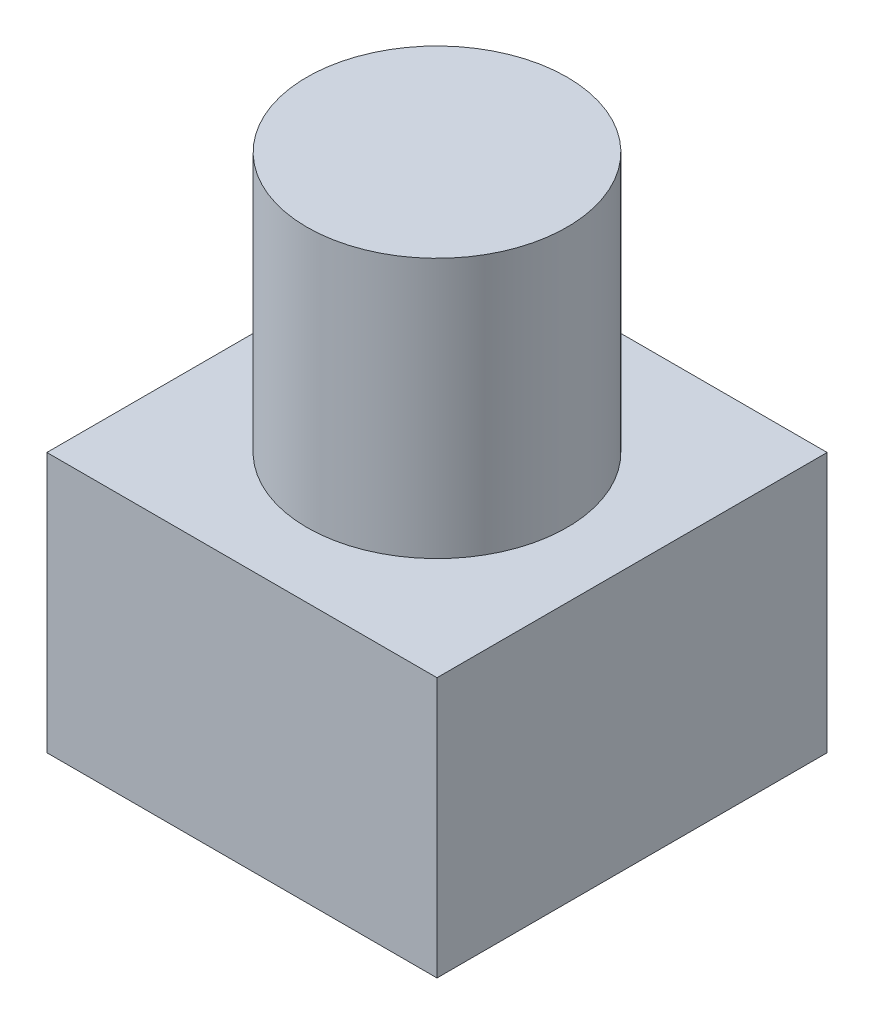
ISO-10303-21;
HEADER;
FILE_DESCRIPTION(('STEP AP214'),'2;1');
FILE_NAME('part.step','',(''),(''),'','','');
FILE_SCHEMA(('AUTOMOTIVE_DESIGN { 1 0 10303 214 1 1 1 1 }'));
ENDSEC;
DATA;
#1=APPLICATION_CONTEXT('core data for automotive mechanical design processes');
#2=APPLICATION_PROTOCOL_DEFINITION('international standard','automotive_design',2000,#1);
#3=PRODUCT_CONTEXT('',#1,'mechanical');
#4=PRODUCT('Part','Part','',(#3));
#5=PRODUCT_RELATED_PRODUCT_CATEGORY('part','',(#4));
#6=PRODUCT_DEFINITION_FORMATION('','',#4);
#7=PRODUCT_DEFINITION_CONTEXT('part definition',#1,'design');
#8=PRODUCT_DEFINITION('design','',#6,#7);
#9=PRODUCT_DEFINITION_SHAPE('','',#8);
#10=(LENGTH_UNIT() NAMED_UNIT(*) SI_UNIT(.MILLI.,.METRE.));
#11=(NAMED_UNIT(*) PLANE_ANGLE_UNIT() SI_UNIT($,.RADIAN.));
#12=(NAMED_UNIT(*) SI_UNIT($,.STERADIAN.) SOLID_ANGLE_UNIT());
#13=UNCERTAINTY_MEASURE_WITH_UNIT(LENGTH_MEASURE(1.E-05),#10,'distance_accuracy_value','');
#14=(GEOMETRIC_REPRESENTATION_CONTEXT(3) GLOBAL_UNCERTAINTY_ASSIGNED_CONTEXT((#13)) GLOBAL_UNIT_ASSIGNED_CONTEXT((#10,
#11,#12)) REPRESENTATION_CONTEXT('',''));
#15=CARTESIAN_POINT('',(0.,0.,0.));
#16=DIRECTION('',(0.,0.,1.));
#17=DIRECTION('',(1.,0.,0.));
#18=AXIS2_PLACEMENT_3D('',#15,#16,#17);
#19=CARTESIAN_POINT('',(0.,20.,0.));
#20=DIRECTION('',(0.,-1.,0.));
#21=DIRECTION('',(0.,0.,-1.));
#22=AXIS2_PLACEMENT_3D('',#19,#20,#21);
#23=CYLINDRICAL_SURFACE('',#22,5.);
#24=CARTESIAN_POINT('',(0.,10.,0.));
#25=DIRECTION('',(0.,1.,0.));
#26=DIRECTION('',(0.,0.,1.));
#27=AXIS2_PLACEMENT_3D('',#24,#25,#26);
#28=CIRCLE('',#27,5.);
#29=CARTESIAN_POINT('',(0.,10.,5.));
#30=VERTEX_POINT('',#29);
#31=EDGE_CURVE('E135',#30,#30,#28,.T.);
#32=ORIENTED_EDGE('',*,*,#31,.T.);
#33=EDGE_LOOP('',(#32));
#34=FACE_BOUND('',#33,.T.);
#35=CARTESIAN_POINT('',(0.,20.,0.));
#36=DIRECTION('',(0.,1.,0.));
#37=DIRECTION('',(0.,0.,1.));
#38=AXIS2_PLACEMENT_3D('',#35,#36,#37);
#39=CIRCLE('',#38,5.);
#40=CARTESIAN_POINT('',(0.,20.,5.));
#41=VERTEX_POINT('',#40);
#42=EDGE_CURVE('E11',#41,#41,#39,.T.);
#43=ORIENTED_EDGE('',*,*,#42,.F.);
#44=EDGE_LOOP('',(#43));
#45=FACE_BOUND('',#44,.T.);
#46=ADVANCED_FACE('F50',(#34,#45),#23,.T.);
#47=CARTESIAN_POINT('',(0.,20.,0.));
#48=DIRECTION('',(0.,1.,0.));
#49=DIRECTION('',(0.,0.,1.));
#50=AXIS2_PLACEMENT_3D('',#47,#48,#49);
#51=PLANE('',#50);
#52=ORIENTED_EDGE('',*,*,#42,.T.);
#53=EDGE_LOOP('',(#52));
#54=FACE_BOUND('',#53,.T.);
#55=ADVANCED_FACE('F155',(#54),#51,.T.);
#56=CARTESIAN_POINT('',(0.,10.,7.5));
#57=DIRECTION('',(0.,0.,-1.));
#58=DIRECTION('',(-1.,0.,0.));
#59=AXIS2_PLACEMENT_3D('',#56,#57,#58);
#60=PLANE('',#59);
#61=DIRECTION('',(1.,0.,0.));
#62=VECTOR('',#61,1.);
#63=CARTESIAN_POINT('',(0.,0.,7.5));
#64=LINE('',#63,#62);
#65=CARTESIAN_POINT('',(-7.5,0.,7.5));
#66=VERTEX_POINT('',#65);
#67=CARTESIAN_POINT('',(7.5,0.,7.5));
#68=VERTEX_POINT('',#67);
#69=EDGE_CURVE('E123',#66,#68,#64,.T.);
#70=ORIENTED_EDGE('',*,*,#69,.T.);
#71=DIRECTION('',(0.,-1.,0.));
#72=VECTOR('',#71,1.);
#73=CARTESIAN_POINT('',(7.5,10.,7.5));
#74=LINE('',#73,#72);
#75=CARTESIAN_POINT('',(7.5,10.,7.5));
#76=VERTEX_POINT('',#75);
#77=EDGE_CURVE('E59',#76,#68,#74,.T.);
#78=ORIENTED_EDGE('',*,*,#77,.F.);
#79=DIRECTION('',(1.,0.,0.));
#80=VECTOR('',#79,1.);
#81=CARTESIAN_POINT('',(0.,10.,7.5));
#82=LINE('',#81,#80);
#83=CARTESIAN_POINT('',(-7.5,10.,7.5));
#84=VERTEX_POINT('',#83);
#85=EDGE_CURVE('E101',#84,#76,#82,.T.);
#86=ORIENTED_EDGE('',*,*,#85,.F.);
#87=DIRECTION('',(0.,-1.,0.));
#88=VECTOR('',#87,1.);
#89=CARTESIAN_POINT('',(-7.5,10.,7.5));
#90=LINE('',#89,#88);
#91=EDGE_CURVE('E67',#84,#66,#90,.T.);
#92=ORIENTED_EDGE('',*,*,#91,.T.);
#93=EDGE_LOOP('',(#70,#78,#86,#92));
#94=FACE_BOUND('',#93,.T.);
#95=ADVANCED_FACE('F141',(#94),#60,.F.);
#96=CARTESIAN_POINT('',(7.5,10.,0.));
#97=DIRECTION('',(-1.,0.,0.));
#98=DIRECTION('',(0.,0.,1.));
#99=AXIS2_PLACEMENT_3D('',#96,#97,#98);
#100=PLANE('',#99);
#101=DIRECTION('',(0.,0.,-1.));
#102=VECTOR('',#101,1.);
#103=CARTESIAN_POINT('',(7.5,0.,0.));
#104=LINE('',#103,#102);
#105=CARTESIAN_POINT('',(7.5,0.,-7.5));
#106=VERTEX_POINT('',#105);
#107=EDGE_CURVE('E108',#68,#106,#104,.T.);
#108=ORIENTED_EDGE('',*,*,#107,.T.);
#109=DIRECTION('',(0.,-1.,0.));
#110=VECTOR('',#109,1.);
#111=CARTESIAN_POINT('',(7.5,10.,-7.5));
#112=LINE('',#111,#110);
#113=CARTESIAN_POINT('',(7.5,10.,-7.5));
#114=VERTEX_POINT('',#113);
#115=EDGE_CURVE('E106',#114,#106,#112,.T.);
#116=ORIENTED_EDGE('',*,*,#115,.F.);
#117=DIRECTION('',(0.,0.,-1.));
#118=VECTOR('',#117,1.);
#119=CARTESIAN_POINT('',(7.5,10.,0.));
#120=LINE('',#119,#118);
#121=EDGE_CURVE('E93',#76,#114,#120,.T.);
#122=ORIENTED_EDGE('',*,*,#121,.F.);
#123=ORIENTED_EDGE('',*,*,#77,.T.);
#124=EDGE_LOOP('',(#108,#116,#122,#123));
#125=FACE_BOUND('',#124,.T.);
#126=ADVANCED_FACE('F107',(#125),#100,.F.);
#127=CARTESIAN_POINT('',(0.,10.,-7.5));
#128=DIRECTION('',(0.,0.,-1.));
#129=DIRECTION('',(-1.,0.,0.));
#130=AXIS2_PLACEMENT_3D('',#127,#128,#129);
#131=PLANE('',#130);
#132=DIRECTION('',(1.,0.,0.));
#133=VECTOR('',#132,1.);
#134=CARTESIAN_POINT('',(0.,0.,-7.5));
#135=LINE('',#134,#133);
#136=CARTESIAN_POINT('',(-7.5,0.,-7.5));
#137=VERTEX_POINT('',#136);
#138=EDGE_CURVE('E128',#137,#106,#135,.T.);
#139=ORIENTED_EDGE('',*,*,#138,.F.);
#140=DIRECTION('',(0.,-1.,0.));
#141=VECTOR('',#140,1.);
#142=CARTESIAN_POINT('',(-7.5,10.,-7.5));
#143=LINE('',#142,#141);
#144=CARTESIAN_POINT('',(-7.5,10.,-7.5));
#145=VERTEX_POINT('',#144);
#146=EDGE_CURVE('E81',#145,#137,#143,.T.);
#147=ORIENTED_EDGE('',*,*,#146,.F.);
#148=DIRECTION('',(1.,0.,0.));
#149=VECTOR('',#148,1.);
#150=CARTESIAN_POINT('',(0.,10.,-7.5));
#151=LINE('',#150,#149);
#152=EDGE_CURVE('E100',#145,#114,#151,.T.);
#153=ORIENTED_EDGE('',*,*,#152,.T.);
#154=ORIENTED_EDGE('',*,*,#115,.T.);
#155=EDGE_LOOP('',(#139,#147,#153,#154));
#156=FACE_BOUND('',#155,.T.);
#157=ADVANCED_FACE('F113',(#156),#131,.T.);
#158=CARTESIAN_POINT('',(-7.5,10.,0.));
#159=DIRECTION('',(-1.,0.,0.));
#160=DIRECTION('',(0.,0.,1.));
#161=AXIS2_PLACEMENT_3D('',#158,#159,#160);
#162=PLANE('',#161);
#163=DIRECTION('',(0.,0.,-1.));
#164=VECTOR('',#163,1.);
#165=CARTESIAN_POINT('',(-7.5,0.,0.));
#166=LINE('',#165,#164);
#167=EDGE_CURVE('E131',#66,#137,#166,.T.);
#168=ORIENTED_EDGE('',*,*,#167,.F.);
#169=ORIENTED_EDGE('',*,*,#91,.F.);
#170=DIRECTION('',(0.,0.,-1.));
#171=VECTOR('',#170,1.);
#172=CARTESIAN_POINT('',(-7.5,10.,0.));
#173=LINE('',#172,#171);
#174=EDGE_CURVE('E115',#84,#145,#173,.T.);
#175=ORIENTED_EDGE('',*,*,#174,.T.);
#176=ORIENTED_EDGE('',*,*,#146,.T.);
#177=EDGE_LOOP('',(#168,#169,#175,#176));
#178=FACE_BOUND('',#177,.T.);
#179=ADVANCED_FACE('F144',(#178),#162,.T.);
#180=CARTESIAN_POINT('',(0.,10.,0.));
#181=DIRECTION('',(0.,1.,0.));
#182=DIRECTION('',(0.,0.,1.));
#183=AXIS2_PLACEMENT_3D('',#180,#181,#182);
#184=PLANE('',#183);
#185=ORIENTED_EDGE('',*,*,#31,.F.);
#186=EDGE_LOOP('',(#185));
#187=FACE_BOUND('',#186,.T.);
#188=ORIENTED_EDGE('',*,*,#85,.T.);
#189=ORIENTED_EDGE('',*,*,#121,.T.);
#190=ORIENTED_EDGE('',*,*,#152,.F.);
#191=ORIENTED_EDGE('',*,*,#174,.F.);
#192=EDGE_LOOP('',(#188,#189,#190,#191));
#193=FACE_BOUND('',#192,.T.);
#194=ADVANCED_FACE('F97',(#187,#193),#184,.T.);
#195=CARTESIAN_POINT('',(0.,0.,0.));
#196=DIRECTION('',(0.,1.,0.));
#197=DIRECTION('',(0.,0.,1.));
#198=AXIS2_PLACEMENT_3D('',#195,#196,#197);
#199=PLANE('',#198);
#200=ORIENTED_EDGE('',*,*,#69,.F.);
#201=ORIENTED_EDGE('',*,*,#167,.T.);
#202=ORIENTED_EDGE('',*,*,#138,.T.);
#203=ORIENTED_EDGE('',*,*,#107,.F.);
#204=EDGE_LOOP('',(#200,#201,#202,#203));
#205=FACE_BOUND('',#204,.T.);
#206=ADVANCED_FACE('F143',(#205),#199,.F.);
#207=CLOSED_SHELL('',(#46,#55,#95,#126,#157,#179,#194,#206));
#208=MANIFOLD_SOLID_BREP('B2',#207);
#209=ADVANCED_BREP_SHAPE_REPRESENTATION('',(#18,#208),#14);
#210=SHAPE_DEFINITION_REPRESENTATION(#9,#209);
ENDSEC;
END-ISO-10303-21;
